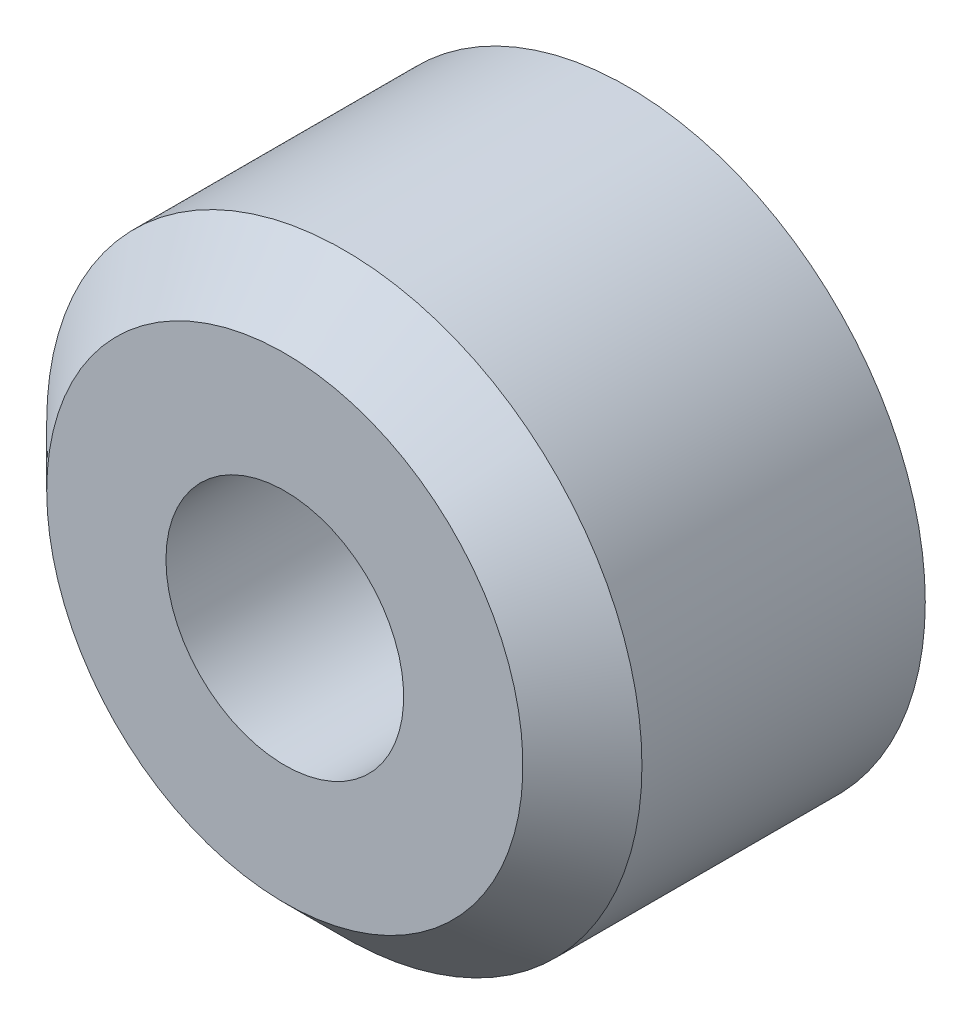
ISO-10303-21;
HEADER;
FILE_DESCRIPTION(('STEP AP214'),'2;1');
FILE_NAME('part.step','',(''),(''),'','','');
FILE_SCHEMA(('AUTOMOTIVE_DESIGN { 1 0 10303 214 1 1 1 1 }'));
ENDSEC;
DATA;
#1=APPLICATION_CONTEXT('core data for automotive mechanical design processes');
#2=APPLICATION_PROTOCOL_DEFINITION('international standard','automotive_design',2000,#1);
#3=PRODUCT_CONTEXT('',#1,'mechanical');
#4=PRODUCT('Part','Part','',(#3));
#5=PRODUCT_RELATED_PRODUCT_CATEGORY('part','',(#4));
#6=PRODUCT_DEFINITION_FORMATION('','',#4);
#7=PRODUCT_DEFINITION_CONTEXT('part definition',#1,'design');
#8=PRODUCT_DEFINITION('design','',#6,#7);
#9=PRODUCT_DEFINITION_SHAPE('','',#8);
#10=(LENGTH_UNIT() NAMED_UNIT(*) SI_UNIT(.MILLI.,.METRE.));
#11=(NAMED_UNIT(*) PLANE_ANGLE_UNIT() SI_UNIT($,.RADIAN.));
#12=(NAMED_UNIT(*) SI_UNIT($,.STERADIAN.) SOLID_ANGLE_UNIT());
#13=UNCERTAINTY_MEASURE_WITH_UNIT(LENGTH_MEASURE(1.E-05),#10,'distance_accuracy_value','');
#14=(GEOMETRIC_REPRESENTATION_CONTEXT(3) GLOBAL_UNCERTAINTY_ASSIGNED_CONTEXT((#13)) GLOBAL_UNIT_ASSIGNED_CONTEXT((#10,
#11,#12)) REPRESENTATION_CONTEXT('',''));
#15=CARTESIAN_POINT('',(0.,0.,0.));
#16=DIRECTION('',(0.,0.,1.));
#17=DIRECTION('',(1.,0.,0.));
#18=AXIS2_PLACEMENT_3D('',#15,#16,#17);
#19=CARTESIAN_POINT('',(0.,0.,4.572));
#20=DIRECTION('',(0.,0.,-1.));
#21=DIRECTION('',(-1.,0.,0.));
#22=AXIS2_PLACEMENT_3D('',#19,#20,#21);
#23=CYLINDRICAL_SURFACE('',#22,3.96874999999742);
#24=CARTESIAN_POINT('',(0.,0.,3.7782500000014));
#25=DIRECTION('',(0.,0.,-1.));
#26=DIRECTION('',(-1.,0.,0.));
#27=AXIS2_PLACEMENT_3D('',#24,#25,#26);
#28=CIRCLE('',#27,3.96874999999742);
#29=CARTESIAN_POINT('',(-3.96874999999742,0.,3.7782500000014));
#30=VERTEX_POINT('',#29);
#31=EDGE_CURVE('E10',#30,#30,#28,.T.);
#32=ORIENTED_EDGE('',*,*,#31,.T.);
#33=EDGE_LOOP('',(#32));
#34=FACE_BOUND('',#33,.T.);
#35=CARTESIAN_POINT('',(0.,0.,0.));
#36=DIRECTION('',(0.,0.,-1.));
#37=DIRECTION('',(-1.,0.,0.));
#38=AXIS2_PLACEMENT_3D('',#35,#36,#37);
#39=CIRCLE('',#38,3.96874999999742);
#40=CARTESIAN_POINT('',(-3.96874999999742,0.,0.));
#41=VERTEX_POINT('',#40);
#42=EDGE_CURVE('E49',#41,#41,#39,.T.);
#43=ORIENTED_EDGE('',*,*,#42,.F.);
#44=EDGE_LOOP('',(#43));
#45=FACE_BOUND('',#44,.T.);
#46=ADVANCED_FACE('F30',(#34,#45),#23,.T.);
#47=CARTESIAN_POINT('',(0.,0.,3.7782500000014));
#48=DIRECTION('',(0.,0.,-1.));
#49=DIRECTION('',(-1.,0.,0.));
#50=AXIS2_PLACEMENT_3D('',#47,#48,#49);
#51=CONICAL_SURFACE('',#50,3.96874999999742,0.785398163397448);
#52=CARTESIAN_POINT('',(0.,0.,4.572));
#53=DIRECTION('',(0.,0.,-1.));
#54=DIRECTION('',(-1.,0.,0.));
#55=AXIS2_PLACEMENT_3D('',#52,#53,#54);
#56=CIRCLE('',#55,3.17499999999882);
#57=CARTESIAN_POINT('',(-3.17499999999882,0.,4.572));
#58=VERTEX_POINT('',#57);
#59=EDGE_CURVE('E36',#58,#58,#56,.T.);
#60=ORIENTED_EDGE('',*,*,#59,.T.);
#61=EDGE_LOOP('',(#60));
#62=FACE_BOUND('',#61,.T.);
#63=ORIENTED_EDGE('',*,*,#31,.F.);
#64=EDGE_LOOP('',(#63));
#65=FACE_BOUND('',#64,.T.);
#66=ADVANCED_FACE('F57',(#62,#65),#51,.T.);
#67=CARTESIAN_POINT('',(3.17499999999882,0.,4.572));
#68=DIRECTION('',(0.,0.,1.));
#69=DIRECTION('',(1.,0.,0.));
#70=AXIS2_PLACEMENT_3D('',#67,#68,#69);
#71=PLANE('',#70);
#72=CARTESIAN_POINT('',(0.,0.,4.572));
#73=DIRECTION('',(0.,0.,-1.));
#74=DIRECTION('',(-1.,0.,0.));
#75=AXIS2_PLACEMENT_3D('',#72,#73,#74);
#76=CIRCLE('',#75,1.58496);
#77=CARTESIAN_POINT('',(-1.58496,0.,4.572));
#78=VERTEX_POINT('',#77);
#79=EDGE_CURVE('E40',#78,#78,#76,.T.);
#80=ORIENTED_EDGE('',*,*,#79,.T.);
#81=EDGE_LOOP('',(#80));
#82=FACE_BOUND('',#81,.T.);
#83=ORIENTED_EDGE('',*,*,#59,.F.);
#84=EDGE_LOOP('',(#83));
#85=FACE_BOUND('',#84,.T.);
#86=ADVANCED_FACE('F61',(#82,#85),#71,.T.);
#87=CARTESIAN_POINT('',(0.,0.,4.572));
#88=DIRECTION('',(0.,0.,-1.));
#89=DIRECTION('',(-1.,0.,0.));
#90=AXIS2_PLACEMENT_3D('',#87,#88,#89);
#91=CYLINDRICAL_SURFACE('',#90,1.58496);
#92=CARTESIAN_POINT('',(0.,0.,0.));
#93=DIRECTION('',(0.,0.,-1.));
#94=DIRECTION('',(-1.,0.,0.));
#95=AXIS2_PLACEMENT_3D('',#92,#93,#94);
#96=CIRCLE('',#95,1.58496);
#97=CARTESIAN_POINT('',(-1.58496,0.,0.));
#98=VERTEX_POINT('',#97);
#99=EDGE_CURVE('E44',#98,#98,#96,.T.);
#100=ORIENTED_EDGE('',*,*,#99,.T.);
#101=EDGE_LOOP('',(#100));
#102=FACE_BOUND('',#101,.T.);
#103=ORIENTED_EDGE('',*,*,#79,.F.);
#104=EDGE_LOOP('',(#103));
#105=FACE_BOUND('',#104,.T.);
#106=ADVANCED_FACE('F65',(#102,#105),#91,.F.);
#107=CARTESIAN_POINT('',(1.58496,0.,0.));
#108=DIRECTION('',(0.,0.,-1.));
#109=DIRECTION('',(-1.,0.,0.));
#110=AXIS2_PLACEMENT_3D('',#107,#108,#109);
#111=PLANE('',#110);
#112=ORIENTED_EDGE('',*,*,#42,.T.);
#113=EDGE_LOOP('',(#112));
#114=FACE_BOUND('',#113,.T.);
#115=ORIENTED_EDGE('',*,*,#99,.F.);
#116=EDGE_LOOP('',(#115));
#117=FACE_BOUND('',#116,.T.);
#118=ADVANCED_FACE('F53',(#114,#117),#111,.T.);
#119=CLOSED_SHELL('',(#46,#66,#86,#106,#118));
#120=MANIFOLD_SOLID_BREP('B2',#119);
#121=ADVANCED_BREP_SHAPE_REPRESENTATION('',(#18,#120),#14);
#122=SHAPE_DEFINITION_REPRESENTATION(#9,#121);
ENDSEC;
END-ISO-10303-21;
